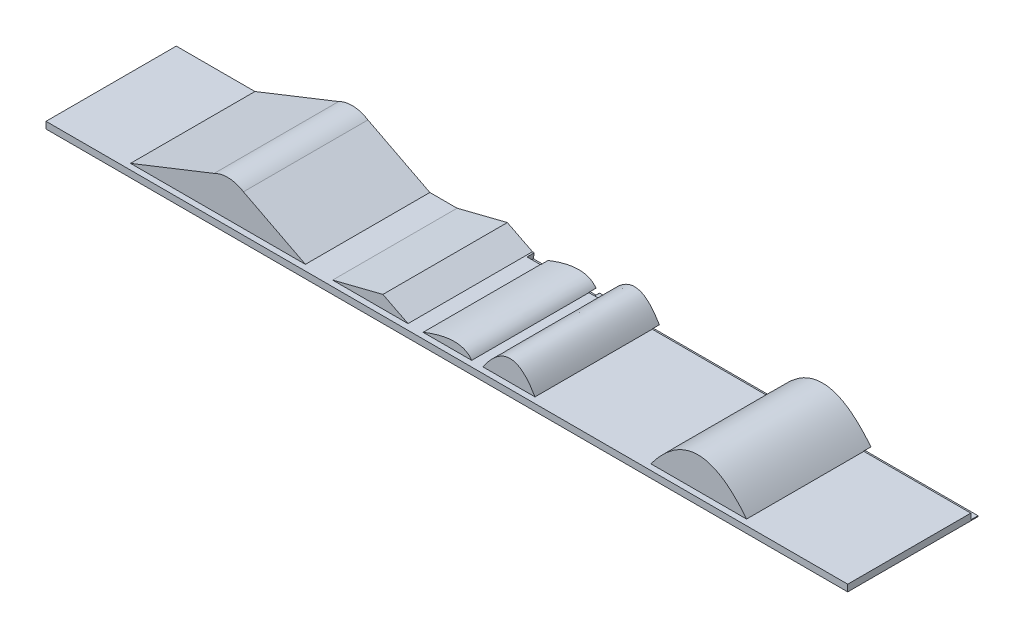
ISO-10303-21;
HEADER;
FILE_DESCRIPTION(('STEP AP214'),'2;1');
FILE_NAME('part.step','',(''),(''),'','','');
FILE_SCHEMA(('AUTOMOTIVE_DESIGN { 1 0 10303 214 1 1 1 1 }'));
ENDSEC;
DATA;
#1=APPLICATION_CONTEXT('core data for automotive mechanical design processes');
#2=APPLICATION_PROTOCOL_DEFINITION('international standard','automotive_design',2000,#1);
#3=PRODUCT_CONTEXT('',#1,'mechanical');
#4=PRODUCT('Part','Part','',(#3));
#5=PRODUCT_RELATED_PRODUCT_CATEGORY('part','',(#4));
#6=PRODUCT_DEFINITION_FORMATION('','',#4);
#7=PRODUCT_DEFINITION_CONTEXT('part definition',#1,'design');
#8=PRODUCT_DEFINITION('design','',#6,#7);
#9=PRODUCT_DEFINITION_SHAPE('','',#8);
#10=(LENGTH_UNIT() NAMED_UNIT(*) SI_UNIT(.MILLI.,.METRE.));
#11=(NAMED_UNIT(*) PLANE_ANGLE_UNIT() SI_UNIT($,.RADIAN.));
#12=(NAMED_UNIT(*) SI_UNIT($,.STERADIAN.) SOLID_ANGLE_UNIT());
#13=UNCERTAINTY_MEASURE_WITH_UNIT(LENGTH_MEASURE(1.E-05),#10,'distance_accuracy_value','');
#14=(GEOMETRIC_REPRESENTATION_CONTEXT(3) GLOBAL_UNCERTAINTY_ASSIGNED_CONTEXT((#13)) GLOBAL_UNIT_ASSIGNED_CONTEXT((#10,
#11,#12)) REPRESENTATION_CONTEXT('',''));
#15=CARTESIAN_POINT('',(0.,0.,0.));
#16=DIRECTION('',(0.,0.,1.));
#17=DIRECTION('',(1.,0.,0.));
#18=AXIS2_PLACEMENT_3D('',#15,#16,#17);
#19=CARTESIAN_POINT('',(-2000.,33.5253932637192,-1440.));
#20=DIRECTION('',(0.,-1.,0.));
#21=DIRECTION('',(0.,0.,-1.));
#22=AXIS2_PLACEMENT_3D('',#19,#20,#21);
#23=PLANE('',#22);
#24=DIRECTION('',(1.,0.,0.));
#25=VECTOR('',#24,1.);
#26=CARTESIAN_POINT('',(-2000.,33.5253932637192,325.));
#27=LINE('',#26,#25);
#28=CARTESIAN_POINT('',(-2000.,33.5253932637192,325.));
#29=VERTEX_POINT('',#28);
#30=CARTESIAN_POINT('',(2000.,33.5253932637192,325.));
#31=VERTEX_POINT('',#30);
#32=EDGE_CURVE('E401',#29,#31,#27,.T.);
#33=ORIENTED_EDGE('',*,*,#32,.T.);
#34=DIRECTION('',(0.,0.,1.));
#35=VECTOR('',#34,1.);
#36=CARTESIAN_POINT('',(2000.,33.5253932637192,-325.));
#37=LINE('',#36,#35);
#38=CARTESIAN_POINT('',(2000.,33.5253932637193,-289.));
#39=VERTEX_POINT('',#38);
#40=EDGE_CURVE('E411',#39,#31,#37,.T.);
#41=ORIENTED_EDGE('',*,*,#40,.F.);
#42=DIRECTION('',(1.,0.,0.));
#43=VECTOR('',#42,1.);
#44=CARTESIAN_POINT('',(-2000.,33.5253932637192,-289.));
#45=LINE('',#44,#43);
#46=CARTESIAN_POINT('',(1466.41150292215,33.5253932637192,-289.));
#47=VERTEX_POINT('',#46);
#48=EDGE_CURVE('E574',#47,#39,#45,.T.);
#49=ORIENTED_EDGE('',*,*,#48,.F.);
#50=DIRECTION('',(0.,0.,-1.));
#51=VECTOR('',#50,1.);
#52=CARTESIAN_POINT('',(1466.41150292215,33.5253932637192,296.));
#53=LINE('',#52,#51);
#54=CARTESIAN_POINT('',(1466.41150292215,33.5253932637192,296.));
#55=VERTEX_POINT('',#54);
#56=EDGE_CURVE('E395',#55,#47,#53,.T.);
#57=ORIENTED_EDGE('',*,*,#56,.F.);
#58=DIRECTION('',(1.,0.,0.));
#59=VECTOR('',#58,1.);
#60=CARTESIAN_POINT('',(0.,33.5253932637192,296.));
#61=LINE('',#60,#59);
#62=CARTESIAN_POINT('',(988.6071915258,33.5253932637192,296.));
#63=VERTEX_POINT('',#62);
#64=EDGE_CURVE('E384',#63,#55,#61,.T.);
#65=ORIENTED_EDGE('',*,*,#64,.F.);
#66=DIRECTION('',(0.,0.,-1.));
#67=VECTOR('',#66,1.);
#68=CARTESIAN_POINT('',(988.6071915258,33.5253932637192,296.));
#69=LINE('',#68,#67);
#70=CARTESIAN_POINT('',(988.6071915258,33.5253932637192,-289.));
#71=VERTEX_POINT('',#70);
#72=EDGE_CURVE('E383',#63,#71,#69,.T.);
#73=ORIENTED_EDGE('',*,*,#72,.T.);
#74=CARTESIAN_POINT('',(410.743928036992,33.5253932637192,-289.));
#75=VERTEX_POINT('',#74);
#76=EDGE_CURVE('E587',#75,#71,#45,.T.);
#77=ORIENTED_EDGE('',*,*,#76,.F.);
#78=DIRECTION('',(0.,0.,-1.));
#79=VECTOR('',#78,1.);
#80=CARTESIAN_POINT('',(410.743928036992,33.5253932637192,296.));
#81=LINE('',#80,#79);
#82=CARTESIAN_POINT('',(410.743928036992,33.5253932637192,296.));
#83=VERTEX_POINT('',#82);
#84=EDGE_CURVE('E965',#83,#75,#81,.T.);
#85=ORIENTED_EDGE('',*,*,#84,.F.);
#86=DIRECTION('',(1.,0.,0.));
#87=VECTOR('',#86,1.);
#88=CARTESIAN_POINT('',(0.,33.5253932637192,296.));
#89=LINE('',#88,#87);
#90=CARTESIAN_POINT('',(151.03808039347,33.5253932637192,296.));
#91=VERTEX_POINT('',#90);
#92=EDGE_CURVE('E356',#91,#83,#89,.T.);
#93=ORIENTED_EDGE('',*,*,#92,.F.);
#94=DIRECTION('',(0.,0.,-1.));
#95=VECTOR('',#94,1.);
#96=CARTESIAN_POINT('',(151.03808039347,33.5253932637192,296.));
#97=LINE('',#96,#95);
#98=CARTESIAN_POINT('',(151.03808039347,33.5253932637192,-289.));
#99=VERTEX_POINT('',#98);
#100=EDGE_CURVE('E394',#91,#99,#97,.T.);
#101=ORIENTED_EDGE('',*,*,#100,.T.);
#102=CARTESIAN_POINT('',(94.9439219923513,33.5253932637192,-289.));
#103=VERTEX_POINT('',#102);
#104=EDGE_CURVE('E563',#103,#99,#45,.T.);
#105=ORIENTED_EDGE('',*,*,#104,.F.);
#106=DIRECTION('',(0.,0.,-1.));
#107=VECTOR('',#106,1.);
#108=CARTESIAN_POINT('',(94.9439219923513,33.5253932637192,296.));
#109=LINE('',#108,#107);
#110=CARTESIAN_POINT('',(94.9439219923513,33.5253932637192,296.));
#111=VERTEX_POINT('',#110);
#112=EDGE_CURVE('E336',#111,#103,#109,.T.);
#113=ORIENTED_EDGE('',*,*,#112,.F.);
#114=DIRECTION('',(1.,0.,0.));
#115=VECTOR('',#114,1.);
#116=CARTESIAN_POINT('',(0.,33.5253932637192,296.));
#117=LINE('',#116,#115);
#118=CARTESIAN_POINT('',(-147.62807094031,33.5253932637192,296.));
#119=VERTEX_POINT('',#118);
#120=EDGE_CURVE('E328',#119,#111,#117,.T.);
#121=ORIENTED_EDGE('',*,*,#120,.F.);
#122=DIRECTION('',(0.,0.,-1.));
#123=VECTOR('',#122,1.);
#124=CARTESIAN_POINT('',(-147.62807094031,33.5253932637192,296.));
#125=LINE('',#124,#123);
#126=CARTESIAN_POINT('',(-147.62807094031,33.5253932637192,-289.));
#127=VERTEX_POINT('',#126);
#128=EDGE_CURVE('E342',#119,#127,#125,.T.);
#129=ORIENTED_EDGE('',*,*,#128,.T.);
#130=CARTESIAN_POINT('',(-214.072052911106,33.5253932637192,-289.));
#131=VERTEX_POINT('',#130);
#132=EDGE_CURVE('E448',#131,#127,#45,.T.);
#133=ORIENTED_EDGE('',*,*,#132,.F.);
#134=DIRECTION('',(0.,0.,-1.));
#135=VECTOR('',#134,1.);
#136=CARTESIAN_POINT('',(-214.072052911106,33.5253932637192,-1440.));
#137=LINE('',#136,#135);
#138=CARTESIAN_POINT('',(-214.072052911106,33.5253932637193,-325.));
#139=VERTEX_POINT('',#138);
#140=EDGE_CURVE('E602',#131,#139,#137,.T.);
#141=ORIENTED_EDGE('',*,*,#140,.T.);
#142=DIRECTION('',(1.,0.,0.));
#143=VECTOR('',#142,1.);
#144=CARTESIAN_POINT('',(-2000.,33.5253932637192,-325.));
#145=LINE('',#144,#143);
#146=CARTESIAN_POINT('',(-222.810217101765,33.5253932637192,-325.));
#147=VERTEX_POINT('',#146);
#148=EDGE_CURVE('E407',#147,#139,#145,.T.);
#149=ORIENTED_EDGE('',*,*,#148,.F.);
#150=DIRECTION('',(0.,0.,-1.));
#151=VECTOR('',#150,1.);
#152=CARTESIAN_POINT('',(-222.810217101765,33.5253932637192,296.));
#153=LINE('',#152,#151);
#154=CARTESIAN_POINT('',(-222.810217101765,33.5253932637192,296.));
#155=VERTEX_POINT('',#154);
#156=EDGE_CURVE('E642',#155,#147,#153,.T.);
#157=ORIENTED_EDGE('',*,*,#156,.F.);
#158=DIRECTION('',(1.,0.,0.));
#159=VECTOR('',#158,1.);
#160=CARTESIAN_POINT('',(0.,33.5253932637192,296.));
#161=LINE('',#160,#159);
#162=CARTESIAN_POINT('',(-598.976164598647,33.5253932637192,296.));
#163=VERTEX_POINT('',#162);
#164=EDGE_CURVE('E636',#163,#155,#161,.T.);
#165=ORIENTED_EDGE('',*,*,#164,.F.);
#166=DIRECTION('',(0.,0.,-1.));
#167=VECTOR('',#166,1.);
#168=CARTESIAN_POINT('',(-598.976164598647,33.5253932637192,296.));
#169=LINE('',#168,#167);
#170=CARTESIAN_POINT('',(-598.976164598647,33.5253932637192,-325.));
#171=VERTEX_POINT('',#170);
#172=EDGE_CURVE('E341',#163,#171,#169,.T.);
#173=ORIENTED_EDGE('',*,*,#172,.T.);
#174=CARTESIAN_POINT('',(-734.829470358558,33.5253932637192,-325.));
#175=VERTEX_POINT('',#174);
#176=EDGE_CURVE('E412',#175,#171,#145,.T.);
#177=ORIENTED_EDGE('',*,*,#176,.F.);
#178=DIRECTION('',(0.,0.,-1.));
#179=VECTOR('',#178,1.);
#180=CARTESIAN_POINT('',(-734.829470358558,33.5253932637192,296.));
#181=LINE('',#180,#179);
#182=CARTESIAN_POINT('',(-734.829470358558,33.5253932637192,296.));
#183=VERTEX_POINT('',#182);
#184=EDGE_CURVE('E627',#183,#175,#181,.T.);
#185=ORIENTED_EDGE('',*,*,#184,.F.);
#186=DIRECTION('',(1.,0.,0.));
#187=VECTOR('',#186,1.);
#188=CARTESIAN_POINT('',(0.,33.5253932637192,296.));
#189=LINE('',#188,#187);
#190=CARTESIAN_POINT('',(-1607.48769191688,33.5253932637193,296.));
#191=VERTEX_POINT('',#190);
#192=EDGE_CURVE('E611',#191,#183,#189,.T.);
#193=ORIENTED_EDGE('',*,*,#192,.F.);
#194=DIRECTION('',(0.,0.,-1.));
#195=VECTOR('',#194,1.);
#196=CARTESIAN_POINT('',(-1607.48769191688,33.5253932637193,296.));
#197=LINE('',#196,#195);
#198=CARTESIAN_POINT('',(-1607.48769191688,33.5253932637193,-325.));
#199=VERTEX_POINT('',#198);
#200=EDGE_CURVE('E624',#191,#199,#197,.T.);
#201=ORIENTED_EDGE('',*,*,#200,.T.);
#202=CARTESIAN_POINT('',(-2000.,33.5253932637192,-325.));
#203=VERTEX_POINT('',#202);
#204=EDGE_CURVE('E408',#203,#199,#145,.T.);
#205=ORIENTED_EDGE('',*,*,#204,.F.);
#206=DIRECTION('',(0.,0.,1.));
#207=VECTOR('',#206,1.);
#208=CARTESIAN_POINT('',(-2000.,33.5253932637192,-1440.));
#209=LINE('',#208,#207);
#210=EDGE_CURVE('E405',#203,#29,#209,.T.);
#211=ORIENTED_EDGE('',*,*,#210,.T.);
#212=EDGE_LOOP('',(#33,#41,#49,#57,#65,#73,#77,#85,#93,#101,#105,#113,#121,#129,#133,#141,#149,
#157,#165,#173,#177,#185,#193,#201,#205,#211));
#213=FACE_BOUND('',#212,.T.);
#214=ADVANCED_FACE('F37',(#213),#23,.F.);
#215=CARTESIAN_POINT('',(-2000.,300.,-325.));
#216=DIRECTION('',(0.,0.,1.));
#217=DIRECTION('',(1.,0.,0.));
#218=AXIS2_PLACEMENT_3D('',#215,#216,#217);
#219=PLANE('',#218);
#220=CARTESIAN_POINT('',(988.6071915258,33.5253932637192,-325.));
#221=CARTESIAN_POINT('',(1220.10432542819,346.541530652494,-325.));
#222=CARTESIAN_POINT('',(1466.41150292215,33.5253932637192,-325.));
#223=B_SPLINE_CURVE_WITH_KNOTS('',2,(#220,#221,#222),.UNSPECIFIED.,.F.,.F.,(3,3),(0.,1.),.UNSPECIFIED.);
#224=CARTESIAN_POINT('',(989.295511666401,34.4546695030383,-325.));
#225=VERTEX_POINT('',#224);
#226=CARTESIAN_POINT('',(1465.6792150113,34.4546695030383,-325.));
#227=VERTEX_POINT('',#226);
#228=EDGE_CURVE('E386',#225,#227,#223,.T.);
#229=ORIENTED_EDGE('',*,*,#228,.T.);
#230=DIRECTION('',(1.,0.,0.));
#231=VECTOR('',#230,1.);
#232=CARTESIAN_POINT('',(2000.,34.4546695030383,-325.));
#233=LINE('',#232,#231);
#234=EDGE_CURVE('E461',#225,#227,#233,.T.);
#235=ORIENTED_EDGE('',*,*,#234,.F.);
#236=EDGE_LOOP('',(#229,#235));
#237=FACE_BOUND('',#236,.T.);
#238=ADVANCED_FACE('F531',(#237),#219,.F.);
#239=CARTESIAN_POINT('',(410.743928036992,33.5253932637192,-325.));
#240=CARTESIAN_POINT('',(291.46653542441,240.977763655567,-325.));
#241=CARTESIAN_POINT('',(151.03808039347,33.5253932637191,-325.));
#242=B_SPLINE_CURVE_WITH_KNOTS('',2,(#239,#240,#241),.UNSPECIFIED.,.F.,.F.,(3,3),(0.,1.),.UNSPECIFIED.);
#243=CARTESIAN_POINT('',(410.208320123229,34.4546695030383,-325.));
#244=VERTEX_POINT('',#243);
#245=CARTESIAN_POINT('',(151.668433812939,34.4546695030383,-325.));
#246=VERTEX_POINT('',#245);
#247=EDGE_CURVE('E348',#244,#246,#242,.T.);
#248=ORIENTED_EDGE('',*,*,#247,.F.);
#249=EDGE_CURVE('E459',#246,#244,#233,.T.);
#250=ORIENTED_EDGE('',*,*,#249,.F.);
#251=EDGE_LOOP('',(#248,#250));
#252=FACE_BOUND('',#251,.T.);
#253=ADVANCED_FACE('F536',(#252),#219,.F.);
#254=CARTESIAN_POINT('',(94.9439219923513,33.5253932637192,-325.));
#255=CARTESIAN_POINT('',(41.7848802010818,109.912399551957,-325.));
#256=CARTESIAN_POINT('',(-147.62807094031,33.5253932637192,-325.));
#257=B_SPLINE_CURVE_WITH_KNOTS('',2,(#254,#255,#256),.UNSPECIFIED.,.F.,.F.,(3,3),(0.,1.),.UNSPECIFIED.);
#258=CARTESIAN_POINT('',(94.288136726731,34.4546695030383,-325.));
#259=VERTEX_POINT('',#258);
#260=CARTESIAN_POINT('',(-145.314706339065,34.4546695030383,-325.));
#261=VERTEX_POINT('',#260);
#262=EDGE_CURVE('E329',#259,#261,#257,.T.);
#263=ORIENTED_EDGE('',*,*,#262,.F.);
#264=EDGE_CURVE('E267',#261,#259,#233,.T.);
#265=ORIENTED_EDGE('',*,*,#264,.F.);
#266=EDGE_LOOP('',(#263,#265));
#267=FACE_BOUND('',#266,.T.);
#268=ADVANCED_FACE('F458',(#267),#219,.F.);
#269=CARTESIAN_POINT('',(2000.,300.,-325.));
#270=DIRECTION('',(-1.,0.,0.));
#271=DIRECTION('',(0.,0.,1.));
#272=AXIS2_PLACEMENT_3D('',#269,#270,#271);
#273=PLANE('',#272);
#274=DIRECTION('',(0.,-1.,0.));
#275=VECTOR('',#274,1.);
#276=CARTESIAN_POINT('',(2000.,300.,-325.));
#277=LINE('',#276,#275);
#278=CARTESIAN_POINT('',(2000.,4.39512456949664,-325.));
#279=VERTEX_POINT('',#278);
#280=CARTESIAN_POINT('',(2000.,0.,-325.));
#281=VERTEX_POINT('',#280);
#282=EDGE_CURVE('E433',#279,#281,#277,.T.);
#283=ORIENTED_EDGE('',*,*,#282,.F.);
#284=DIRECTION('',(0.,0.,-1.));
#285=VECTOR('',#284,1.);
#286=CARTESIAN_POINT('',(2000.,4.39512456949664,-289.));
#287=LINE('',#286,#285);
#288=CARTESIAN_POINT('',(2000.,4.39512456949664,-289.));
#289=VERTEX_POINT('',#288);
#290=EDGE_CURVE('E556',#289,#279,#287,.T.);
#291=ORIENTED_EDGE('',*,*,#290,.F.);
#292=DIRECTION('',(0.,-1.,0.));
#293=VECTOR('',#292,1.);
#294=CARTESIAN_POINT('',(2000.,4.39512456949664,-289.));
#295=LINE('',#294,#293);
#296=EDGE_CURVE('E453',#39,#289,#295,.T.);
#297=ORIENTED_EDGE('',*,*,#296,.F.);
#298=ORIENTED_EDGE('',*,*,#40,.T.);
#299=DIRECTION('',(0.,-1.,0.));
#300=VECTOR('',#299,1.);
#301=CARTESIAN_POINT('',(2000.,300.,325.));
#302=LINE('',#301,#300);
#303=CARTESIAN_POINT('',(2000.,0.,325.));
#304=VERTEX_POINT('',#303);
#305=EDGE_CURVE('E427',#31,#304,#302,.T.);
#306=ORIENTED_EDGE('',*,*,#305,.T.);
#307=DIRECTION('',(0.,0.,-1.));
#308=VECTOR('',#307,1.);
#309=CARTESIAN_POINT('',(2000.,0.,-325.));
#310=LINE('',#309,#308);
#311=EDGE_CURVE('E415',#304,#281,#310,.T.);
#312=ORIENTED_EDGE('',*,*,#311,.T.);
#313=EDGE_LOOP('',(#283,#291,#297,#298,#306,#312));
#314=FACE_BOUND('',#313,.T.);
#315=ADVANCED_FACE('F39',(#314),#273,.F.);
#316=CARTESIAN_POINT('',(154.790798000181,4.39512456949664,-325.));
#317=CARTESIAN_POINT('',(122.121165818751,28.8494157297573,-325.));
#318=CARTESIAN_POINT('',(111.562876496082,29.4861177662181,-325.));
#319=CARTESIAN_POINT('',(96.0419536861471,4.76761106891383,-325.));
#320=B_SPLINE_CURVE_WITH_KNOTS('',3,(#316,#317,#318,#319),.UNSPECIFIED.,.F.,.F.,(4,4),(0.,1.),.UNSPECIFIED.);
#321=CARTESIAN_POINT('',(154.790798000181,4.39512456949664,-325.));
#322=VERTEX_POINT('',#321);
#323=CARTESIAN_POINT('',(96.0419536861471,4.76761106891383,-325.));
#324=VERTEX_POINT('',#323);
#325=EDGE_CURVE('E247',#322,#324,#320,.T.);
#326=ORIENTED_EDGE('',*,*,#325,.F.);
#327=DIRECTION('',(-1.,0.,0.));
#328=VECTOR('',#327,1.);
#329=CARTESIAN_POINT('',(2000.,4.39512456949664,-325.));
#330=LINE('',#329,#328);
#331=EDGE_CURVE('E264',#279,#322,#330,.T.);
#332=ORIENTED_EDGE('',*,*,#331,.F.);
#333=ORIENTED_EDGE('',*,*,#282,.T.);
#334=DIRECTION('',(-1.,0.,0.));
#335=VECTOR('',#334,1.);
#336=CARTESIAN_POINT('',(-2000.,0.,-325.));
#337=LINE('',#336,#335);
#338=CARTESIAN_POINT('',(-2000.,0.,-325.));
#339=VERTEX_POINT('',#338);
#340=EDGE_CURVE('E418',#281,#339,#337,.T.);
#341=ORIENTED_EDGE('',*,*,#340,.T.);
#342=DIRECTION('',(0.,-1.,0.));
#343=VECTOR('',#342,1.);
#344=CARTESIAN_POINT('',(-2000.,300.,-325.));
#345=LINE('',#344,#343);
#346=EDGE_CURVE('E431',#203,#339,#345,.T.);
#347=ORIENTED_EDGE('',*,*,#346,.F.);
#348=ORIENTED_EDGE('',*,*,#204,.T.);
#349=DIRECTION('',(-0.929671565981438,-0.368389439867134,0.));
#350=VECTOR('',#349,1.);
#351=CARTESIAN_POINT('',(-229.635224049746,579.509929556674,-325.));
#352=LINE('',#351,#350);
#353=CARTESIAN_POINT('',(-1190.09110042634,198.92197219353,-325.));
#354=VERTEX_POINT('',#353);
#355=EDGE_CURVE('E609',#354,#199,#352,.T.);
#356=ORIENTED_EDGE('',*,*,#355,.F.);
#357=CARTESIAN_POINT('',(-1122.67035321263,69.4858889495294,-325.));
#358=DIRECTION('',(0.,0.,-1.));
#359=DIRECTION('',(-1.,0.,0.));
#360=AXIS2_PLACEMENT_3D('',#357,#358,#359);
#361=CIRCLE('',#360,145.94264901119);
#362=CARTESIAN_POINT('',(-1043.88094278074,192.333296753679,-325.));
#363=VERTEX_POINT('',#362);
#364=EDGE_CURVE('E604',#363,#354,#361,.F.);
#365=ORIENTED_EDGE('',*,*,#364,.F.);
#366=DIRECTION('',(-0.8894432580745,0.45704561114381,0.));
#367=VECTOR('',#366,1.);
#368=CARTESIAN_POINT('',(-139.870422208255,-272.197787275155,-325.));
#369=LINE('',#368,#367);
#370=EDGE_CURVE('E60',#175,#363,#369,.T.);
#371=ORIENTED_EDGE('',*,*,#370,.F.);
#372=ORIENTED_EDGE('',*,*,#176,.T.);
#373=DIRECTION('',(-0.969496067164754,-0.245106865983137,0.));
#374=VECTOR('',#373,1.);
#375=CARTESIAN_POINT('',(-43.9515600893007,173.846067026388,-325.));
#376=LINE('',#375,#374);
#377=CARTESIAN_POINT('',(-348.198866267392,96.9266176064338,-325.));
#378=VERTEX_POINT('',#377);
#379=EDGE_CURVE('E623',#378,#171,#376,.T.);
#380=ORIENTED_EDGE('',*,*,#379,.F.);
#381=DIRECTION('',(-0.892405699762124,0.451233938253844,0.));
#382=VECTOR('',#381,1.);
#383=CARTESIAN_POINT('',(-31.8667181683917,-63.0228325383363,-325.));
#384=LINE('',#383,#382);
#385=EDGE_CURVE('E634',#147,#378,#384,.T.);
#386=ORIENTED_EDGE('',*,*,#385,.F.);
#387=ORIENTED_EDGE('',*,*,#148,.T.);
#388=DIRECTION('',(0.154376880273607,0.988012033751102,0.));
#389=VECTOR('',#388,1.);
#390=CARTESIAN_POINT('',(-213.926853498712,34.4546695030383,-325.));
#391=LINE('',#390,#389);
#392=CARTESIAN_POINT('',(-218.452868680464,5.48817233982651,-325.));
#393=VERTEX_POINT('',#392);
#394=EDGE_CURVE('E463',#393,#139,#391,.T.);
#395=ORIENTED_EDGE('',*,*,#394,.F.);
#396=DIRECTION('',(-1.,0.,0.));
#397=VECTOR('',#396,1.);
#398=CARTESIAN_POINT('',(-142.868415145208,5.48817233982651,-325.));
#399=LINE('',#398,#397);
#400=CARTESIAN_POINT('',(-142.868415145208,5.48817233982648,-325.));
#401=VERTEX_POINT('',#400);
#402=EDGE_CURVE('E467',#401,#393,#399,.T.);
#403=ORIENTED_EDGE('',*,*,#402,.F.);
#404=CARTESIAN_POINT('',(-73.6203828644052,4.58296930347614,-325.));
#405=CARTESIAN_POINT('',(-101.904065397845,17.0277896181898,-325.));
#406=CARTESIAN_POINT('',(-102.64541223735,9.52818734861475,-325.));
#407=CARTESIAN_POINT('',(-123.323430354368,0.559894651668684,-325.));
#408=CARTESIAN_POINT('',(-134.386420176311,12.8392346462042,-325.));
#409=CARTESIAN_POINT('',(-142.868415145208,5.48817233982648,-325.));
#410=B_SPLINE_CURVE_WITH_KNOTS('',3,(#404,#405,#406,#407,#408,#409),.UNSPECIFIED.,.F.,.F.,(4,1,
1,4),(0.,0.498478211039703,0.598478211039703,1.),.UNSPECIFIED.);
#411=CARTESIAN_POINT('',(-73.6203828644052,4.58296930347614,-325.));
#412=VERTEX_POINT('',#411);
#413=EDGE_CURVE('E472',#412,#401,#410,.T.);
#414=ORIENTED_EDGE('',*,*,#413,.F.);
#415=CARTESIAN_POINT('',(-24.2868173833101,4.76761106891383,-325.));
#416=CARTESIAN_POINT('',(-43.5203772253972,22.6390068847438,-325.));
#417=CARTESIAN_POINT('',(-73.6203828644052,4.58296930347614,-325.));
#418=B_SPLINE_CURVE_WITH_KNOTS('',2,(#415,#416,#417),.UNSPECIFIED.,.F.,.F.,(3,3),(0.,1.),.UNSPECIFIED.);
#419=CARTESIAN_POINT('',(-24.2868173833101,4.76761106891383,-325.));
#420=VERTEX_POINT('',#419);
#421=EDGE_CURVE('E479',#420,#412,#418,.T.);
#422=ORIENTED_EDGE('',*,*,#421,.F.);
#423=DIRECTION('',(-1.,0.,0.));
#424=VECTOR('',#423,1.);
#425=CARTESIAN_POINT('',(96.0419536861471,4.76761106891383,-325.));
#426=LINE('',#425,#424);
#427=EDGE_CURVE('E487',#324,#420,#426,.T.);
#428=ORIENTED_EDGE('',*,*,#427,.F.);
#429=EDGE_LOOP('',(#326,#332,#333,#341,#347,#348,#356,#365,#371,#372,#380,#386,#387,#395,#403,
#414,#422,#428));
#430=FACE_BOUND('',#429,.T.);
#431=ADVANCED_FACE('F538',(#430),#219,.F.);
#432=CARTESIAN_POINT('',(-2000.,300.,-325.));
#433=DIRECTION('',(1.,0.,0.));
#434=DIRECTION('',(0.,0.,-1.));
#435=AXIS2_PLACEMENT_3D('',#432,#433,#434);
#436=PLANE('',#435);
#437=DIRECTION('',(0.,-1.,0.));
#438=VECTOR('',#437,1.);
#439=CARTESIAN_POINT('',(-2000.,300.,325.));
#440=LINE('',#439,#438);
#441=CARTESIAN_POINT('',(-2000.,0.,325.));
#442=VERTEX_POINT('',#441);
#443=EDGE_CURVE('E429',#29,#442,#440,.T.);
#444=ORIENTED_EDGE('',*,*,#443,.F.);
#445=ORIENTED_EDGE('',*,*,#210,.F.);
#446=ORIENTED_EDGE('',*,*,#346,.T.);
#447=DIRECTION('',(0.,0.,1.));
#448=VECTOR('',#447,1.);
#449=CARTESIAN_POINT('',(-2000.,0.,-325.));
#450=LINE('',#449,#448);
#451=EDGE_CURVE('E421',#339,#442,#450,.T.);
#452=ORIENTED_EDGE('',*,*,#451,.T.);
#453=EDGE_LOOP('',(#444,#445,#446,#452));
#454=FACE_BOUND('',#453,.T.);
#455=ADVANCED_FACE('F743',(#454),#436,.F.);
#456=CARTESIAN_POINT('',(-2000.,300.,325.));
#457=DIRECTION('',(0.,0.,-1.));
#458=DIRECTION('',(-1.,0.,0.));
#459=AXIS2_PLACEMENT_3D('',#456,#457,#458);
#460=PLANE('',#459);
#461=ORIENTED_EDGE('',*,*,#305,.F.);
#462=ORIENTED_EDGE('',*,*,#32,.F.);
#463=ORIENTED_EDGE('',*,*,#443,.T.);
#464=DIRECTION('',(1.,0.,0.));
#465=VECTOR('',#464,1.);
#466=CARTESIAN_POINT('',(-2000.,0.,325.));
#467=LINE('',#466,#465);
#468=EDGE_CURVE('E424',#442,#304,#467,.T.);
#469=ORIENTED_EDGE('',*,*,#468,.T.);
#470=EDGE_LOOP('',(#461,#462,#463,#469));
#471=FACE_BOUND('',#470,.T.);
#472=ADVANCED_FACE('F550',(#471),#460,.F.);
#473=CARTESIAN_POINT('',(0.,0.,0.));
#474=DIRECTION('',(0.,1.,0.));
#475=DIRECTION('',(0.,0.,1.));
#476=AXIS2_PLACEMENT_3D('',#473,#474,#475);
#477=PLANE('',#476);
#478=ORIENTED_EDGE('',*,*,#311,.F.);
#479=ORIENTED_EDGE('',*,*,#468,.F.);
#480=ORIENTED_EDGE('',*,*,#451,.F.);
#481=ORIENTED_EDGE('',*,*,#340,.F.);
#482=EDGE_LOOP('',(#478,#479,#480,#481));
#483=FACE_BOUND('',#482,.T.);
#484=ADVANCED_FACE('F373',(#483),#477,.F.);
#485=CARTESIAN_POINT('',(988.6071915258,33.5253932637192,296.));
#486=CARTESIAN_POINT('',(1220.10432542819,346.541530652494,296.));
#487=CARTESIAN_POINT('',(1466.41150292215,33.5253932637192,296.));
#488=B_SPLINE_CURVE_WITH_KNOTS('',2,(#485,#486,#487),.UNSPECIFIED.,.F.,.F.,(3,3),(0.,1.),.UNSPECIFIED.);
#489=DIRECTION('',(0.,0.,-1.));
#490=VECTOR('',#489,1.);
#491=SURFACE_OF_LINEAR_EXTRUSION('',#488,#490);
#492=DIRECTION('',(0.,0.,-1.));
#493=VECTOR('',#492,1.);
#494=CARTESIAN_POINT('',(1465.67921501132,34.4546695030384,296.));
#495=LINE('',#494,#493);
#496=CARTESIAN_POINT('',(1465.6792150113,34.4546695030383,-289.));
#497=VERTEX_POINT('',#496);
#498=EDGE_CURVE('E598',#227,#497,#495,.F.);
#499=ORIENTED_EDGE('',*,*,#498,.F.);
#500=ORIENTED_EDGE('',*,*,#228,.F.);
#501=DIRECTION('',(0.,0.,-1.));
#502=VECTOR('',#501,1.);
#503=CARTESIAN_POINT('',(989.295511666384,34.4546695030383,296.));
#504=LINE('',#503,#502);
#505=CARTESIAN_POINT('',(989.295511666401,34.4546695030383,-289.));
#506=VERTEX_POINT('',#505);
#507=EDGE_CURVE('E600',#506,#225,#504,.T.);
#508=ORIENTED_EDGE('',*,*,#507,.F.);
#509=CARTESIAN_POINT('',(988.6071915258,33.5253932637192,-289.));
#510=CARTESIAN_POINT('',(1220.10432542819,346.541530652494,-289.));
#511=CARTESIAN_POINT('',(1466.41150292215,33.5253932637192,-289.));
#512=B_SPLINE_CURVE_WITH_KNOTS('',2,(#509,#510,#511),.UNSPECIFIED.,.F.,.F.,(3,3),(0.,1.),.UNSPECIFIED.);
#513=EDGE_CURVE('E579',#506,#71,#512,.F.);
#514=ORIENTED_EDGE('',*,*,#513,.T.);
#515=ORIENTED_EDGE('',*,*,#72,.F.);
#516=EDGE_CURVE('E376',#63,#55,#488,.T.);
#517=ORIENTED_EDGE('',*,*,#516,.T.);
#518=ORIENTED_EDGE('',*,*,#56,.T.);
#519=EDGE_CURVE('E588',#47,#497,#512,.F.);
#520=ORIENTED_EDGE('',*,*,#519,.T.);
#521=EDGE_LOOP('',(#499,#500,#508,#514,#515,#517,#518,#520));
#522=FACE_BOUND('',#521,.T.);
#523=ADVANCED_FACE('F368',(#522),#491,.T.);
#524=CARTESIAN_POINT('',(0.,0.,296.));
#525=DIRECTION('',(0.,0.,-1.));
#526=DIRECTION('',(-1.,0.,0.));
#527=AXIS2_PLACEMENT_3D('',#524,#525,#526);
#528=PLANE('',#527);
#529=ORIENTED_EDGE('',*,*,#64,.T.);
#530=ORIENTED_EDGE('',*,*,#516,.F.);
#531=EDGE_LOOP('',(#529,#530));
#532=FACE_BOUND('',#531,.T.);
#533=ADVANCED_FACE('F364',(#532),#528,.F.);
#534=CARTESIAN_POINT('',(410.743928036992,33.5253932637192,296.));
#535=CARTESIAN_POINT('',(291.46653542441,240.977763655567,296.));
#536=CARTESIAN_POINT('',(151.03808039347,33.5253932637191,296.));
#537=B_SPLINE_CURVE_WITH_KNOTS('',2,(#534,#535,#536),.UNSPECIFIED.,.F.,.F.,(3,3),(0.,1.),.UNSPECIFIED.);
#538=DIRECTION('',(0.,0.,-1.));
#539=VECTOR('',#538,1.);
#540=SURFACE_OF_LINEAR_EXTRUSION('',#537,#539);
#541=ORIENTED_EDGE('',*,*,#247,.T.);
#542=DIRECTION('',(0.,0.,-1.));
#543=VECTOR('',#542,1.);
#544=CARTESIAN_POINT('',(151.668433812904,34.4546695030383,296.));
#545=LINE('',#544,#543);
#546=CARTESIAN_POINT('',(151.668433812939,34.4546695030383,-289.));
#547=VERTEX_POINT('',#546);
#548=EDGE_CURVE('E589',#246,#547,#545,.F.);
#549=ORIENTED_EDGE('',*,*,#548,.T.);
#550=CARTESIAN_POINT('',(410.743928036992,33.5253932637192,-289.));
#551=CARTESIAN_POINT('',(291.46653542441,240.977763655567,-289.));
#552=CARTESIAN_POINT('',(151.03808039347,33.5253932637191,-289.));
#553=B_SPLINE_CURVE_WITH_KNOTS('',2,(#550,#551,#552),.UNSPECIFIED.,.F.,.F.,(3,3),(0.,1.),.UNSPECIFIED.);
#554=EDGE_CURVE('E573',#99,#547,#553,.F.);
#555=ORIENTED_EDGE('',*,*,#554,.F.);
#556=ORIENTED_EDGE('',*,*,#100,.F.);
#557=EDGE_CURVE('E351',#83,#91,#537,.T.);
#558=ORIENTED_EDGE('',*,*,#557,.F.);
#559=ORIENTED_EDGE('',*,*,#84,.T.);
#560=CARTESIAN_POINT('',(410.208320123229,34.4546695030383,-289.));
#561=VERTEX_POINT('',#560);
#562=EDGE_CURVE('E578',#561,#75,#553,.F.);
#563=ORIENTED_EDGE('',*,*,#562,.F.);
#564=DIRECTION('',(0.,0.,-1.));
#565=VECTOR('',#564,1.);
#566=CARTESIAN_POINT('',(410.208320123259,34.4546695030383,296.));
#567=LINE('',#566,#565);
#568=EDGE_CURVE('E595',#561,#244,#567,.T.);
#569=ORIENTED_EDGE('',*,*,#568,.T.);
#570=EDGE_LOOP('',(#541,#549,#555,#556,#558,#559,#563,#569));
#571=FACE_BOUND('',#570,.T.);
#572=ADVANCED_FACE('F361',(#571),#540,.F.);
#573=CARTESIAN_POINT('',(0.,0.,296.));
#574=DIRECTION('',(0.,0.,-1.));
#575=DIRECTION('',(-1.,0.,0.));
#576=AXIS2_PLACEMENT_3D('',#573,#574,#575);
#577=PLANE('',#576);
#578=ORIENTED_EDGE('',*,*,#557,.T.);
#579=ORIENTED_EDGE('',*,*,#92,.T.);
#580=EDGE_LOOP('',(#578,#579));
#581=FACE_BOUND('',#580,.T.);
#582=ADVANCED_FACE('F319',(#581),#577,.F.);
#583=CARTESIAN_POINT('',(94.9439219923513,33.5253932637192,296.));
#584=CARTESIAN_POINT('',(41.7848802010818,109.912399551957,296.));
#585=CARTESIAN_POINT('',(-147.62807094031,33.5253932637192,296.));
#586=B_SPLINE_CURVE_WITH_KNOTS('',2,(#583,#584,#585),.UNSPECIFIED.,.F.,.F.,(3,3),(0.,1.),.UNSPECIFIED.);
#587=DIRECTION('',(0.,0.,-1.));
#588=VECTOR('',#587,1.);
#589=SURFACE_OF_LINEAR_EXTRUSION('',#586,#588);
#590=ORIENTED_EDGE('',*,*,#262,.T.);
#591=DIRECTION('',(0.,0.,-1.));
#592=VECTOR('',#591,1.);
#593=CARTESIAN_POINT('',(-145.314706387862,34.4546695030383,296.));
#594=LINE('',#593,#592);
#595=CARTESIAN_POINT('',(-145.314706339065,34.4546695030383,-289.));
#596=VERTEX_POINT('',#595);
#597=EDGE_CURVE('E11',#261,#596,#594,.F.);
#598=ORIENTED_EDGE('',*,*,#597,.T.);
#599=CARTESIAN_POINT('',(94.9439219923513,33.5253932637192,-289.));
#600=CARTESIAN_POINT('',(41.7848802010818,109.912399551957,-289.));
#601=CARTESIAN_POINT('',(-147.62807094031,33.5253932637192,-289.));
#602=B_SPLINE_CURVE_WITH_KNOTS('',2,(#599,#600,#601),.UNSPECIFIED.,.F.,.F.,(3,3),(0.,1.),.UNSPECIFIED.);
#603=EDGE_CURVE('E45',#127,#596,#602,.F.);
#604=ORIENTED_EDGE('',*,*,#603,.F.);
#605=ORIENTED_EDGE('',*,*,#128,.F.);
#606=EDGE_CURVE('E322',#111,#119,#586,.T.);
#607=ORIENTED_EDGE('',*,*,#606,.F.);
#608=ORIENTED_EDGE('',*,*,#112,.T.);
#609=CARTESIAN_POINT('',(94.2881367267309,34.4546695225625,-289.));
#610=VERTEX_POINT('',#609);
#611=EDGE_CURVE('E435',#610,#103,#602,.F.);
#612=ORIENTED_EDGE('',*,*,#611,.F.);
#613=DIRECTION('',(0.,0.,-1.));
#614=VECTOR('',#613,1.);
#615=CARTESIAN_POINT('',(94.2881367407022,34.4546695030383,296.));
#616=LINE('',#615,#614);
#617=EDGE_CURVE('E438',#610,#259,#616,.T.);
#618=ORIENTED_EDGE('',*,*,#617,.T.);
#619=EDGE_LOOP('',(#590,#598,#604,#605,#607,#608,#612,#618));
#620=FACE_BOUND('',#619,.T.);
#621=ADVANCED_FACE('F314',(#620),#589,.F.);
#622=CARTESIAN_POINT('',(0.,0.,296.));
#623=DIRECTION('',(0.,0.,-1.));
#624=DIRECTION('',(-1.,0.,0.));
#625=AXIS2_PLACEMENT_3D('',#622,#623,#624);
#626=PLANE('',#625);
#627=ORIENTED_EDGE('',*,*,#606,.T.);
#628=ORIENTED_EDGE('',*,*,#120,.T.);
#629=EDGE_LOOP('',(#627,#628));
#630=FACE_BOUND('',#629,.T.);
#631=ADVANCED_FACE('F310',(#630),#626,.F.);
#632=CARTESIAN_POINT('',(-43.9515600893007,173.846067026388,296.));
#633=DIRECTION('',(0.245106865983137,-0.969496067164754,0.));
#634=DIRECTION('',(0.969496067164754,0.245106865983137,0.));
#635=AXIS2_PLACEMENT_3D('',#632,#633,#634);
#636=PLANE('',#635);
#637=ORIENTED_EDGE('',*,*,#379,.T.);
#638=ORIENTED_EDGE('',*,*,#172,.F.);
#639=DIRECTION('',(-0.969496067164754,-0.245106865983137,0.));
#640=VECTOR('',#639,1.);
#641=CARTESIAN_POINT('',(-43.9515600893007,173.846067026388,296.));
#642=LINE('',#641,#640);
#643=CARTESIAN_POINT('',(-348.198866267392,96.9266176064338,296.));
#644=VERTEX_POINT('',#643);
#645=EDGE_CURVE('E631',#644,#163,#642,.T.);
#646=ORIENTED_EDGE('',*,*,#645,.F.);
#647=DIRECTION('',(0.,0.,-1.));
#648=VECTOR('',#647,1.);
#649=CARTESIAN_POINT('',(-348.198866267392,96.9266176064338,296.));
#650=LINE('',#649,#648);
#651=EDGE_CURVE('E330',#644,#378,#650,.T.);
#652=ORIENTED_EDGE('',*,*,#651,.T.);
#653=EDGE_LOOP('',(#637,#638,#646,#652));
#654=FACE_BOUND('',#653,.T.);
#655=ADVANCED_FACE('F306',(#654),#636,.F.);
#656=CARTESIAN_POINT('',(-31.8667181683917,-63.0228325383363,296.));
#657=DIRECTION('',(-0.451233938253844,-0.892405699762124,0.));
#658=DIRECTION('',(0.892405699762124,-0.451233938253844,0.));
#659=AXIS2_PLACEMENT_3D('',#656,#657,#658);
#660=PLANE('',#659);
#661=ORIENTED_EDGE('',*,*,#385,.T.);
#662=ORIENTED_EDGE('',*,*,#651,.F.);
#663=DIRECTION('',(-0.892405699762124,0.451233938253844,0.));
#664=VECTOR('',#663,1.);
#665=CARTESIAN_POINT('',(-31.8667181683917,-63.0228325383363,296.));
#666=LINE('',#665,#664);
#667=EDGE_CURVE('E633',#155,#644,#666,.T.);
#668=ORIENTED_EDGE('',*,*,#667,.F.);
#669=ORIENTED_EDGE('',*,*,#156,.T.);
#670=EDGE_LOOP('',(#661,#662,#668,#669));
#671=FACE_BOUND('',#670,.T.);
#672=ADVANCED_FACE('F302',(#671),#660,.F.);
#673=CARTESIAN_POINT('',(0.,0.,296.));
#674=DIRECTION('',(0.,0.,-1.));
#675=DIRECTION('',(-1.,0.,0.));
#676=AXIS2_PLACEMENT_3D('',#673,#674,#675);
#677=PLANE('',#676);
#678=ORIENTED_EDGE('',*,*,#645,.T.);
#679=ORIENTED_EDGE('',*,*,#164,.T.);
#680=ORIENTED_EDGE('',*,*,#667,.T.);
#681=EDGE_LOOP('',(#678,#679,#680));
#682=FACE_BOUND('',#681,.T.);
#683=ADVANCED_FACE('F298',(#682),#677,.F.);
#684=CARTESIAN_POINT('',(-1122.67035321263,69.4858889495294,296.));
#685=DIRECTION('',(0.,0.,-1.));
#686=DIRECTION('',(-1.,0.,0.));
#687=AXIS2_PLACEMENT_3D('',#684,#685,#686);
#688=CYLINDRICAL_SURFACE('',#687,145.94264901119);
#689=ORIENTED_EDGE('',*,*,#364,.T.);
#690=DIRECTION('',(0.,0.,-1.));
#691=VECTOR('',#690,1.);
#692=CARTESIAN_POINT('',(-1190.09110042634,198.92197219353,296.));
#693=LINE('',#692,#691);
#694=CARTESIAN_POINT('',(-1190.09110042634,198.92197219353,296.));
#695=VERTEX_POINT('',#694);
#696=EDGE_CURVE('E620',#695,#354,#693,.T.);
#697=ORIENTED_EDGE('',*,*,#696,.F.);
#698=CARTESIAN_POINT('',(-1122.67035321263,69.4858889495294,296.));
#699=DIRECTION('',(0.,0.,-1.));
#700=DIRECTION('',(-1.,0.,0.));
#701=AXIS2_PLACEMENT_3D('',#698,#699,#700);
#702=CIRCLE('',#701,145.94264901119);
#703=CARTESIAN_POINT('',(-1043.88094278074,192.333296753679,296.));
#704=VERTEX_POINT('',#703);
#705=EDGE_CURVE('E605',#704,#695,#702,.F.);
#706=ORIENTED_EDGE('',*,*,#705,.F.);
#707=DIRECTION('',(0.,0.,-1.));
#708=VECTOR('',#707,1.);
#709=CARTESIAN_POINT('',(-1043.88094278074,192.333296753679,296.));
#710=LINE('',#709,#708);
#711=EDGE_CURVE('E615',#704,#363,#710,.T.);
#712=ORIENTED_EDGE('',*,*,#711,.T.);
#713=EDGE_LOOP('',(#689,#697,#706,#712));
#714=FACE_BOUND('',#713,.T.);
#715=ADVANCED_FACE('F291',(#714),#688,.T.);
#716=CARTESIAN_POINT('',(-229.635224049746,579.509929556674,296.));
#717=DIRECTION('',(0.368389439867134,-0.929671565981438,0.));
#718=DIRECTION('',(0.929671565981438,0.368389439867134,0.));
#719=AXIS2_PLACEMENT_3D('',#716,#717,#718);
#720=PLANE('',#719);
#721=ORIENTED_EDGE('',*,*,#355,.T.);
#722=ORIENTED_EDGE('',*,*,#200,.F.);
#723=DIRECTION('',(-0.929671565981438,-0.368389439867134,0.));
#724=VECTOR('',#723,1.);
#725=CARTESIAN_POINT('',(-229.635224049746,579.509929556674,296.));
#726=LINE('',#725,#724);
#727=EDGE_CURVE('E613',#695,#191,#726,.T.);
#728=ORIENTED_EDGE('',*,*,#727,.F.);
#729=ORIENTED_EDGE('',*,*,#696,.T.);
#730=EDGE_LOOP('',(#721,#722,#728,#729));
#731=FACE_BOUND('',#730,.T.);
#732=ADVANCED_FACE('F288',(#731),#720,.F.);
#733=CARTESIAN_POINT('',(-139.870422208255,-272.197787275155,296.));
#734=DIRECTION('',(-0.45704561114381,-0.8894432580745,0.));
#735=DIRECTION('',(0.8894432580745,-0.45704561114381,0.));
#736=AXIS2_PLACEMENT_3D('',#733,#734,#735);
#737=PLANE('',#736);
#738=ORIENTED_EDGE('',*,*,#370,.T.);
#739=ORIENTED_EDGE('',*,*,#711,.F.);
#740=DIRECTION('',(-0.8894432580745,0.45704561114381,0.));
#741=VECTOR('',#740,1.);
#742=CARTESIAN_POINT('',(-139.870422208255,-272.197787275155,296.));
#743=LINE('',#742,#741);
#744=EDGE_CURVE('E608',#183,#704,#743,.T.);
#745=ORIENTED_EDGE('',*,*,#744,.F.);
#746=ORIENTED_EDGE('',*,*,#184,.T.);
#747=EDGE_LOOP('',(#738,#739,#745,#746));
#748=FACE_BOUND('',#747,.T.);
#749=ADVANCED_FACE('F286',(#748),#737,.F.);
#750=CARTESIAN_POINT('',(0.,0.,296.));
#751=DIRECTION('',(0.,0.,-1.));
#752=DIRECTION('',(-1.,0.,0.));
#753=AXIS2_PLACEMENT_3D('',#750,#751,#752);
#754=PLANE('',#753);
#755=ORIENTED_EDGE('',*,*,#705,.T.);
#756=ORIENTED_EDGE('',*,*,#727,.T.);
#757=ORIENTED_EDGE('',*,*,#192,.T.);
#758=ORIENTED_EDGE('',*,*,#744,.T.);
#759=EDGE_LOOP('',(#755,#756,#757,#758));
#760=FACE_BOUND('',#759,.T.);
#761=ADVANCED_FACE('F282',(#760),#754,.F.);
#762=CARTESIAN_POINT('',(-213.926853498712,34.4546695030383,-289.));
#763=DIRECTION('',(-0.988012033751102,0.154376880273607,0.));
#764=DIRECTION('',(-0.154376880273607,-0.988012033751102,0.));
#765=AXIS2_PLACEMENT_3D('',#762,#763,#764);
#766=PLANE('',#765);
#767=DIRECTION('',(0.154376880273607,0.988012033751102,0.));
#768=VECTOR('',#767,1.);
#769=CARTESIAN_POINT('',(-213.926853498712,34.4546695030383,-289.));
#770=LINE('',#769,#768);
#771=CARTESIAN_POINT('',(-218.452868680464,5.48817233982651,-289.));
#772=VERTEX_POINT('',#771);
#773=EDGE_CURVE('E501',#772,#131,#770,.T.);
#774=ORIENTED_EDGE('',*,*,#773,.F.);
#775=DIRECTION('',(0.,0.,-1.));
#776=VECTOR('',#775,1.);
#777=CARTESIAN_POINT('',(-218.452868680464,5.48817233982651,-289.));
#778=LINE('',#777,#776);
#779=EDGE_CURVE('E561',#772,#393,#778,.T.);
#780=ORIENTED_EDGE('',*,*,#779,.T.);
#781=ORIENTED_EDGE('',*,*,#394,.T.);
#782=ORIENTED_EDGE('',*,*,#140,.F.);
#783=EDGE_LOOP('',(#774,#780,#781,#782));
#784=FACE_BOUND('',#783,.T.);
#785=ADVANCED_FACE('F285',(#784),#766,.F.);
#786=CARTESIAN_POINT('',(2000.,34.4546695030383,-289.));
#787=DIRECTION('',(0.,1.,0.));
#788=DIRECTION('',(0.,0.,1.));
#789=AXIS2_PLACEMENT_3D('',#786,#787,#788);
#790=PLANE('',#789);
#791=DIRECTION('',(1.,0.,0.));
#792=VECTOR('',#791,1.);
#793=CARTESIAN_POINT('',(2000.,34.4546695030383,-289.));
#794=LINE('',#793,#792);
#795=EDGE_CURVE('E454',#547,#561,#794,.T.);
#796=ORIENTED_EDGE('',*,*,#795,.F.);
#797=ORIENTED_EDGE('',*,*,#548,.F.);
#798=ORIENTED_EDGE('',*,*,#249,.T.);
#799=ORIENTED_EDGE('',*,*,#568,.F.);
#800=EDGE_LOOP('',(#796,#797,#798,#799));
#801=FACE_BOUND('',#800,.T.);
#802=ADVANCED_FACE('F672',(#801),#790,.F.);
#803=ORIENTED_EDGE('',*,*,#507,.T.);
#804=ORIENTED_EDGE('',*,*,#234,.T.);
#805=ORIENTED_EDGE('',*,*,#498,.T.);
#806=EDGE_CURVE('E456',#506,#497,#794,.T.);
#807=ORIENTED_EDGE('',*,*,#806,.F.);
#808=EDGE_LOOP('',(#803,#804,#805,#807));
#809=FACE_BOUND('',#808,.T.);
#810=ADVANCED_FACE('F674',(#809),#790,.F.);
#811=EDGE_CURVE('E52',#596,#610,#794,.T.);
#812=ORIENTED_EDGE('',*,*,#811,.F.);
#813=ORIENTED_EDGE('',*,*,#597,.F.);
#814=ORIENTED_EDGE('',*,*,#264,.T.);
#815=ORIENTED_EDGE('',*,*,#617,.F.);
#816=EDGE_LOOP('',(#812,#813,#814,#815));
#817=FACE_BOUND('',#816,.T.);
#818=ADVANCED_FACE('F451',(#817),#790,.F.);
#819=CARTESIAN_POINT('',(118.985609828853,23.0211670157921,-289.));
#820=DIRECTION('',(0.,0.,-1.));
#821=DIRECTION('',(-1.,0.,0.));
#822=AXIS2_PLACEMENT_3D('',#819,#820,#821);
#823=PLANE('',#822);
#824=ORIENTED_EDGE('',*,*,#562,.T.);
#825=ORIENTED_EDGE('',*,*,#76,.T.);
#826=ORIENTED_EDGE('',*,*,#513,.F.);
#827=ORIENTED_EDGE('',*,*,#806,.T.);
#828=ORIENTED_EDGE('',*,*,#519,.F.);
#829=ORIENTED_EDGE('',*,*,#48,.T.);
#830=ORIENTED_EDGE('',*,*,#296,.T.);
#831=DIRECTION('',(-1.,0.,0.));
#832=VECTOR('',#831,1.);
#833=CARTESIAN_POINT('',(2000.,4.39512456949664,-289.));
#834=LINE('',#833,#832);
#835=CARTESIAN_POINT('',(154.790798000181,4.39512456949664,-289.));
#836=VERTEX_POINT('',#835);
#837=EDGE_CURVE('E252',#289,#836,#834,.T.);
#838=ORIENTED_EDGE('',*,*,#837,.T.);
#839=CARTESIAN_POINT('',(154.790798000181,4.39512456949664,-289.));
#840=CARTESIAN_POINT('',(122.121165818751,28.8494157297573,-289.));
#841=CARTESIAN_POINT('',(111.562876496082,29.4861177662181,-289.));
#842=CARTESIAN_POINT('',(96.0419536861471,4.76761106891383,-289.));
#843=B_SPLINE_CURVE_WITH_KNOTS('',3,(#839,#840,#841,#842),.UNSPECIFIED.,.F.,.F.,(4,4),(0.,1.),.UNSPECIFIED.);
#844=CARTESIAN_POINT('',(96.0419536861471,4.76761106891383,-289.));
#845=VERTEX_POINT('',#844);
#846=EDGE_CURVE('E244',#836,#845,#843,.T.);
#847=ORIENTED_EDGE('',*,*,#846,.T.);
#848=DIRECTION('',(-1.,0.,0.));
#849=VECTOR('',#848,1.);
#850=CARTESIAN_POINT('',(96.0419536861471,4.76761106891383,-289.));
#851=LINE('',#850,#849);
#852=CARTESIAN_POINT('',(-24.2868173833101,4.76761106891383,-289.));
#853=VERTEX_POINT('',#852);
#854=EDGE_CURVE('E255',#845,#853,#851,.T.);
#855=ORIENTED_EDGE('',*,*,#854,.T.);
#856=CARTESIAN_POINT('',(-24.2868173833101,4.76761106891383,-289.));
#857=CARTESIAN_POINT('',(-43.5203772253972,22.6390068847438,-289.));
#858=CARTESIAN_POINT('',(-73.6203828644052,4.58296930347614,-289.));
#859=B_SPLINE_CURVE_WITH_KNOTS('',2,(#856,#857,#858),.UNSPECIFIED.,.F.,.F.,(3,3),(0.,1.),.UNSPECIFIED.);
#860=CARTESIAN_POINT('',(-73.6203828644052,4.58296930347614,-289.));
#861=VERTEX_POINT('',#860);
#862=EDGE_CURVE('E259',#853,#861,#859,.T.);
#863=ORIENTED_EDGE('',*,*,#862,.T.);
#864=CARTESIAN_POINT('',(-73.6203828644052,4.58296930347614,-289.));
#865=CARTESIAN_POINT('',(-101.904065397845,17.0277896181898,-289.));
#866=CARTESIAN_POINT('',(-102.64541223735,9.52818734861475,-289.));
#867=CARTESIAN_POINT('',(-123.323430354368,0.559894651668684,-289.));
#868=CARTESIAN_POINT('',(-134.386420176311,12.8392346462042,-289.));
#869=CARTESIAN_POINT('',(-142.868415145208,5.48817233982648,-289.));
#870=B_SPLINE_CURVE_WITH_KNOTS('',3,(#864,#865,#866,#867,#868,#869),.UNSPECIFIED.,.F.,.F.,(4,1,
1,4),(0.,0.498478211039703,0.598478211039703,1.),.UNSPECIFIED.);
#871=CARTESIAN_POINT('',(-142.868415145208,5.48817233982648,-289.));
#872=VERTEX_POINT('',#871);
#873=EDGE_CURVE('E506',#861,#872,#870,.T.);
#874=ORIENTED_EDGE('',*,*,#873,.T.);
#875=DIRECTION('',(-1.,0.,0.));
#876=VECTOR('',#875,1.);
#877=CARTESIAN_POINT('',(-142.868415145208,5.48817233982651,-289.));
#878=LINE('',#877,#876);
#879=EDGE_CURVE('E503',#872,#772,#878,.T.);
#880=ORIENTED_EDGE('',*,*,#879,.T.);
#881=ORIENTED_EDGE('',*,*,#773,.T.);
#882=ORIENTED_EDGE('',*,*,#132,.T.);
#883=ORIENTED_EDGE('',*,*,#603,.T.);
#884=ORIENTED_EDGE('',*,*,#811,.T.);
#885=ORIENTED_EDGE('',*,*,#611,.T.);
#886=ORIENTED_EDGE('',*,*,#104,.T.);
#887=ORIENTED_EDGE('',*,*,#554,.T.);
#888=ORIENTED_EDGE('',*,*,#795,.T.);
#889=EDGE_LOOP('',(#824,#825,#826,#827,#828,#829,#830,#838,#847,#855,#863,#874,#880,#881,#882,
#883,#884,#885,#886,#887,#888));
#890=FACE_BOUND('',#889,.T.);
#891=ADVANCED_FACE('F262',(#890),#823,.T.);
#892=DIRECTION('',(0.,0.,-1.));
#893=VECTOR('',#892,1.);
#894=SURFACE_OF_LINEAR_EXTRUSION('',#843,#893);
#895=ORIENTED_EDGE('',*,*,#325,.T.);
#896=DIRECTION('',(0.,0.,-1.));
#897=VECTOR('',#896,1.);
#898=CARTESIAN_POINT('',(96.0419536861471,4.76761106891383,-289.));
#899=LINE('',#898,#897);
#900=EDGE_CURVE('E240',#845,#324,#899,.T.);
#901=ORIENTED_EDGE('',*,*,#900,.F.);
#902=ORIENTED_EDGE('',*,*,#846,.F.);
#903=DIRECTION('',(0.,0.,-1.));
#904=VECTOR('',#903,1.);
#905=CARTESIAN_POINT('',(154.790798000181,4.39512456949664,-289.));
#906=LINE('',#905,#904);
#907=EDGE_CURVE('E560',#836,#322,#906,.T.);
#908=ORIENTED_EDGE('',*,*,#907,.T.);
#909=EDGE_LOOP('',(#895,#901,#902,#908));
#910=FACE_BOUND('',#909,.T.);
#911=ADVANCED_FACE('F242',(#910),#894,.F.);
#912=CARTESIAN_POINT('',(2000.,4.39512456949664,-289.));
#913=DIRECTION('',(0.,-1.,0.));
#914=DIRECTION('',(0.,0.,-1.));
#915=AXIS2_PLACEMENT_3D('',#912,#913,#914);
#916=PLANE('',#915);
#917=ORIENTED_EDGE('',*,*,#331,.T.);
#918=ORIENTED_EDGE('',*,*,#907,.F.);
#919=ORIENTED_EDGE('',*,*,#837,.F.);
#920=ORIENTED_EDGE('',*,*,#290,.T.);
#921=EDGE_LOOP('',(#917,#918,#919,#920));
#922=FACE_BOUND('',#921,.T.);
#923=ADVANCED_FACE('F280',(#922),#916,.F.);
#924=CARTESIAN_POINT('',(-142.868415145208,5.48817233982651,-289.));
#925=DIRECTION('',(0.,-1.,0.));
#926=DIRECTION('',(0.,0.,-1.));
#927=AXIS2_PLACEMENT_3D('',#924,#925,#926);
#928=PLANE('',#927);
#929=ORIENTED_EDGE('',*,*,#402,.T.);
#930=ORIENTED_EDGE('',*,*,#779,.F.);
#931=ORIENTED_EDGE('',*,*,#879,.F.);
#932=DIRECTION('',(0.,0.,-1.));
#933=VECTOR('',#932,1.);
#934=CARTESIAN_POINT('',(-142.868415145208,5.48817233982648,-289.));
#935=LINE('',#934,#933);
#936=EDGE_CURVE('E565',#872,#401,#935,.T.);
#937=ORIENTED_EDGE('',*,*,#936,.T.);
#938=EDGE_LOOP('',(#929,#930,#931,#937));
#939=FACE_BOUND('',#938,.T.);
#940=ADVANCED_FACE('F522',(#939),#928,.F.);
#941=DIRECTION('',(0.,0.,-1.));
#942=VECTOR('',#941,1.);
#943=SURFACE_OF_LINEAR_EXTRUSION('',#870,#942);
#944=ORIENTED_EDGE('',*,*,#413,.T.);
#945=ORIENTED_EDGE('',*,*,#936,.F.);
#946=ORIENTED_EDGE('',*,*,#873,.F.);
#947=DIRECTION('',(0.,0.,-1.));
#948=VECTOR('',#947,1.);
#949=CARTESIAN_POINT('',(-73.6203828644052,4.58296930347614,-289.));
#950=LINE('',#949,#948);
#951=EDGE_CURVE('E569',#861,#412,#950,.T.);
#952=ORIENTED_EDGE('',*,*,#951,.T.);
#953=EDGE_LOOP('',(#944,#945,#946,#952));
#954=FACE_BOUND('',#953,.T.);
#955=ADVANCED_FACE('F518',(#954),#943,.F.);
#956=DIRECTION('',(0.,0.,-1.));
#957=VECTOR('',#956,1.);
#958=SURFACE_OF_LINEAR_EXTRUSION('',#859,#957);
#959=ORIENTED_EDGE('',*,*,#421,.T.);
#960=ORIENTED_EDGE('',*,*,#951,.F.);
#961=ORIENTED_EDGE('',*,*,#862,.F.);
#962=DIRECTION('',(0.,0.,-1.));
#963=VECTOR('',#962,1.);
#964=CARTESIAN_POINT('',(-24.2868173833101,4.76761106891383,-289.));
#965=LINE('',#964,#963);
#966=EDGE_CURVE('E251',#853,#420,#965,.T.);
#967=ORIENTED_EDGE('',*,*,#966,.T.);
#968=EDGE_LOOP('',(#959,#960,#961,#967));
#969=FACE_BOUND('',#968,.T.);
#970=ADVANCED_FACE('F521',(#969),#958,.F.);
#971=CARTESIAN_POINT('',(96.0419536861471,4.76761106891383,-289.));
#972=DIRECTION('',(0.,-1.,0.));
#973=DIRECTION('',(0.,0.,-1.));
#974=AXIS2_PLACEMENT_3D('',#971,#972,#973);
#975=PLANE('',#974);
#976=ORIENTED_EDGE('',*,*,#427,.T.);
#977=ORIENTED_EDGE('',*,*,#966,.F.);
#978=ORIENTED_EDGE('',*,*,#854,.F.);
#979=ORIENTED_EDGE('',*,*,#900,.T.);
#980=EDGE_LOOP('',(#976,#977,#978,#979));
#981=FACE_BOUND('',#980,.T.);
#982=ADVANCED_FACE('F256',(#981),#975,.F.);
#983=CLOSED_SHELL('',(#214,#238,#253,#268,#315,#431,#455,#472,#484,#523,#533,#572,#582,#621,
#631,#655,#672,#683,#715,#732,#749,#761,#785,#802,#810,#818,#891,#911,#923,#940,#955,#970,#982));
#984=MANIFOLD_SOLID_BREP('B2',#983);
#985=ADVANCED_BREP_SHAPE_REPRESENTATION('',(#18,#984),#14);
#986=SHAPE_DEFINITION_REPRESENTATION(#9,#985);
ENDSEC;
END-ISO-10303-21;
